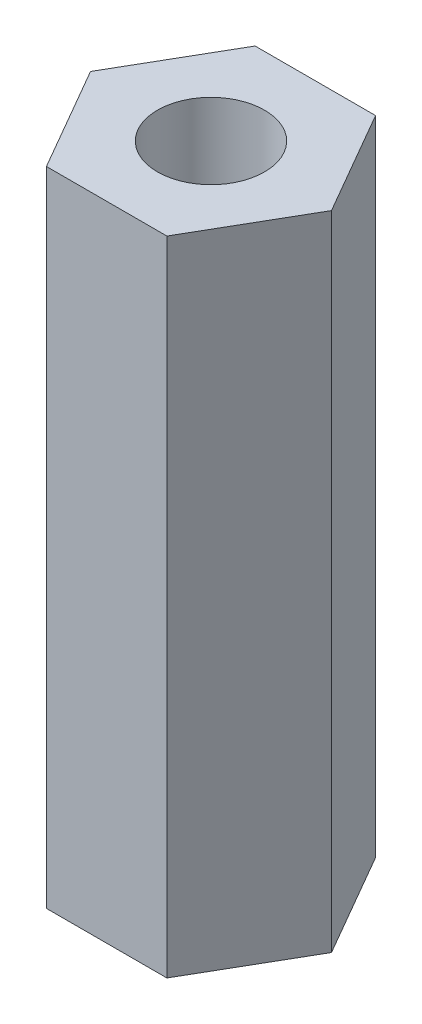
ISO-10303-21;
HEADER;
FILE_DESCRIPTION(('STEP AP214'),'2;1');
FILE_NAME('part.step','',(''),(''),'','','');
FILE_SCHEMA(('AUTOMOTIVE_DESIGN { 1 0 10303 214 1 1 1 1 }'));
ENDSEC;
DATA;
#1=APPLICATION_CONTEXT('core data for automotive mechanical design processes');
#2=APPLICATION_PROTOCOL_DEFINITION('international standard','automotive_design',2000,#1);
#3=PRODUCT_CONTEXT('',#1,'mechanical');
#4=PRODUCT('Part','Part','',(#3));
#5=PRODUCT_RELATED_PRODUCT_CATEGORY('part','',(#4));
#6=PRODUCT_DEFINITION_FORMATION('','',#4);
#7=PRODUCT_DEFINITION_CONTEXT('part definition',#1,'design');
#8=PRODUCT_DEFINITION('design','',#6,#7);
#9=PRODUCT_DEFINITION_SHAPE('','',#8);
#10=(LENGTH_UNIT() NAMED_UNIT(*) SI_UNIT(.MILLI.,.METRE.));
#11=(NAMED_UNIT(*) PLANE_ANGLE_UNIT() SI_UNIT($,.RADIAN.));
#12=(NAMED_UNIT(*) SI_UNIT($,.STERADIAN.) SOLID_ANGLE_UNIT());
#13=UNCERTAINTY_MEASURE_WITH_UNIT(LENGTH_MEASURE(1.E-05),#10,'distance_accuracy_value','');
#14=(GEOMETRIC_REPRESENTATION_CONTEXT(3) GLOBAL_UNCERTAINTY_ASSIGNED_CONTEXT((#13)) GLOBAL_UNIT_ASSIGNED_CONTEXT((#10,
#11,#12)) REPRESENTATION_CONTEXT('',''));
#15=CARTESIAN_POINT('',(0.,0.,0.));
#16=DIRECTION('',(0.,0.,1.));
#17=DIRECTION('',(1.,0.,0.));
#18=AXIS2_PLACEMENT_3D('',#15,#16,#17);
#19=CARTESIAN_POINT('',(0.,12.,0.));
#20=DIRECTION('',(0.,1.,0.));
#21=DIRECTION('',(0.,0.,1.));
#22=AXIS2_PLACEMENT_3D('',#19,#20,#21);
#23=PLANE('',#22);
#24=DIRECTION('',(0.5,0.,-0.866025403784439));
#25=VECTOR('',#24,1.);
#26=CARTESIAN_POINT('',(1.125,12.,1.94855715851499));
#27=LINE('',#26,#25);
#28=CARTESIAN_POINT('',(1.125,12.,1.94855715851499));
#29=VERTEX_POINT('',#28);
#30=CARTESIAN_POINT('',(2.25,12.,0.));
#31=VERTEX_POINT('',#30);
#32=EDGE_CURVE('E131',#29,#31,#27,.T.);
#33=ORIENTED_EDGE('',*,*,#32,.T.);
#34=DIRECTION('',(-0.5,0.,-0.866025403784438));
#35=VECTOR('',#34,1.);
#36=CARTESIAN_POINT('',(2.25,12.,0.));
#37=LINE('',#36,#35);
#38=CARTESIAN_POINT('',(1.125,12.,-1.94855715851499));
#39=VERTEX_POINT('',#38);
#40=EDGE_CURVE('E89',#31,#39,#37,.T.);
#41=ORIENTED_EDGE('',*,*,#40,.T.);
#42=DIRECTION('',(-1.,0.,0.));
#43=VECTOR('',#42,1.);
#44=CARTESIAN_POINT('',(1.125,12.,-1.94855715851499));
#45=LINE('',#44,#43);
#46=CARTESIAN_POINT('',(-1.125,12.,-1.94855715851499));
#47=VERTEX_POINT('',#46);
#48=EDGE_CURVE('E102',#39,#47,#45,.T.);
#49=ORIENTED_EDGE('',*,*,#48,.T.);
#50=DIRECTION('',(-0.5,0.,0.866025403784439));
#51=VECTOR('',#50,1.);
#52=CARTESIAN_POINT('',(-1.125,12.,-1.94855715851499));
#53=LINE('',#52,#51);
#54=CARTESIAN_POINT('',(-2.25,12.,0.));
#55=VERTEX_POINT('',#54);
#56=EDGE_CURVE('E96',#47,#55,#53,.T.);
#57=ORIENTED_EDGE('',*,*,#56,.T.);
#58=DIRECTION('',(0.5,0.,0.866025403784438));
#59=VECTOR('',#58,1.);
#60=CARTESIAN_POINT('',(-2.25,12.,0.));
#61=LINE('',#60,#59);
#62=CARTESIAN_POINT('',(-1.125,12.,1.94855715851499));
#63=VERTEX_POINT('',#62);
#64=EDGE_CURVE('E100',#55,#63,#61,.T.);
#65=ORIENTED_EDGE('',*,*,#64,.T.);
#66=DIRECTION('',(1.,0.,0.));
#67=VECTOR('',#66,1.);
#68=CARTESIAN_POINT('',(-1.125,12.,1.94855715851499));
#69=LINE('',#68,#67);
#70=EDGE_CURVE('E52',#63,#29,#69,.T.);
#71=ORIENTED_EDGE('',*,*,#70,.T.);
#72=EDGE_LOOP('',(#33,#41,#49,#57,#65,#71));
#73=FACE_BOUND('',#72,.T.);
#74=CARTESIAN_POINT('',(0.,12.,0.));
#75=DIRECTION('',(0.,1.,0.));
#76=DIRECTION('',(0.,0.,1.));
#77=AXIS2_PLACEMENT_3D('',#74,#75,#76);
#78=CIRCLE('',#77,1.);
#79=CARTESIAN_POINT('',(0.,12.,1.));
#80=VERTEX_POINT('',#79);
#81=EDGE_CURVE('E124',#80,#80,#78,.T.);
#82=ORIENTED_EDGE('',*,*,#81,.F.);
#83=EDGE_LOOP('',(#82));
#84=FACE_BOUND('',#83,.T.);
#85=ADVANCED_FACE('F35',(#73,#84),#23,.T.);
#86=CARTESIAN_POINT('',(0.,0.,0.));
#87=DIRECTION('',(0.,1.,0.));
#88=DIRECTION('',(0.,0.,1.));
#89=AXIS2_PLACEMENT_3D('',#86,#87,#88);
#90=PLANE('',#89);
#91=DIRECTION('',(0.5,0.,-0.866025403784439));
#92=VECTOR('',#91,1.);
#93=CARTESIAN_POINT('',(1.125,0.,1.94855715851499));
#94=LINE('',#93,#92);
#95=CARTESIAN_POINT('',(1.125,0.,1.94855715851499));
#96=VERTEX_POINT('',#95);
#97=CARTESIAN_POINT('',(2.25,0.,0.));
#98=VERTEX_POINT('',#97);
#99=EDGE_CURVE('E120',#96,#98,#94,.T.);
#100=ORIENTED_EDGE('',*,*,#99,.F.);
#101=DIRECTION('',(1.,0.,0.));
#102=VECTOR('',#101,1.);
#103=CARTESIAN_POINT('',(-1.125,0.,1.94855715851499));
#104=LINE('',#103,#102);
#105=CARTESIAN_POINT('',(-1.125,0.,1.94855715851499));
#106=VERTEX_POINT('',#105);
#107=EDGE_CURVE('E81',#106,#96,#104,.T.);
#108=ORIENTED_EDGE('',*,*,#107,.F.);
#109=DIRECTION('',(0.5,0.,0.866025403784438));
#110=VECTOR('',#109,1.);
#111=CARTESIAN_POINT('',(-2.25,0.,0.));
#112=LINE('',#111,#110);
#113=CARTESIAN_POINT('',(-2.25,0.,0.));
#114=VERTEX_POINT('',#113);
#115=EDGE_CURVE('E75',#114,#106,#112,.T.);
#116=ORIENTED_EDGE('',*,*,#115,.F.);
#117=DIRECTION('',(-0.5,0.,0.866025403784439));
#118=VECTOR('',#117,1.);
#119=CARTESIAN_POINT('',(-1.125,0.,-1.94855715851499));
#120=LINE('',#119,#118);
#121=CARTESIAN_POINT('',(-1.125,0.,-1.94855715851499));
#122=VERTEX_POINT('',#121);
#123=EDGE_CURVE('E110',#122,#114,#120,.T.);
#124=ORIENTED_EDGE('',*,*,#123,.F.);
#125=DIRECTION('',(-1.,0.,0.));
#126=VECTOR('',#125,1.);
#127=CARTESIAN_POINT('',(1.125,0.,-1.94855715851499));
#128=LINE('',#127,#126);
#129=CARTESIAN_POINT('',(1.125,0.,-1.94855715851499));
#130=VERTEX_POINT('',#129);
#131=EDGE_CURVE('E126',#130,#122,#128,.T.);
#132=ORIENTED_EDGE('',*,*,#131,.F.);
#133=DIRECTION('',(-0.5,0.,-0.866025403784438));
#134=VECTOR('',#133,1.);
#135=CARTESIAN_POINT('',(2.25,0.,0.));
#136=LINE('',#135,#134);
#137=EDGE_CURVE('E123',#98,#130,#136,.T.);
#138=ORIENTED_EDGE('',*,*,#137,.F.);
#139=EDGE_LOOP('',(#100,#108,#116,#124,#132,#138));
#140=FACE_BOUND('',#139,.T.);
#141=CARTESIAN_POINT('',(0.,0.,0.));
#142=DIRECTION('',(0.,1.,0.));
#143=DIRECTION('',(0.,0.,1.));
#144=AXIS2_PLACEMENT_3D('',#141,#142,#143);
#145=CIRCLE('',#144,1.);
#146=CARTESIAN_POINT('',(0.,0.,1.));
#147=VERTEX_POINT('',#146);
#148=EDGE_CURVE('E224',#147,#147,#145,.T.);
#149=ORIENTED_EDGE('',*,*,#148,.T.);
#150=EDGE_LOOP('',(#149));
#151=FACE_BOUND('',#150,.T.);
#152=ADVANCED_FACE('F140',(#140,#151),#90,.F.);
#153=CARTESIAN_POINT('',(1.125,12.,1.94855715851499));
#154=DIRECTION('',(-0.866025403784439,0.,-0.5));
#155=DIRECTION('',(-0.5,0.,0.866025403784439));
#156=AXIS2_PLACEMENT_3D('',#153,#154,#155);
#157=PLANE('',#156);
#158=ORIENTED_EDGE('',*,*,#99,.T.);
#159=DIRECTION('',(0.,-1.,0.));
#160=VECTOR('',#159,1.);
#161=CARTESIAN_POINT('',(2.25,12.,0.));
#162=LINE('',#161,#160);
#163=EDGE_CURVE('E11',#31,#98,#162,.T.);
#164=ORIENTED_EDGE('',*,*,#163,.F.);
#165=ORIENTED_EDGE('',*,*,#32,.F.);
#166=DIRECTION('',(0.,-1.,0.));
#167=VECTOR('',#166,1.);
#168=CARTESIAN_POINT('',(1.125,12.,1.94855715851499));
#169=LINE('',#168,#167);
#170=EDGE_CURVE('E116',#29,#96,#169,.T.);
#171=ORIENTED_EDGE('',*,*,#170,.T.);
#172=EDGE_LOOP('',(#158,#164,#165,#171));
#173=FACE_BOUND('',#172,.T.);
#174=ADVANCED_FACE('F37',(#173),#157,.F.);
#175=CARTESIAN_POINT('',(2.25,12.,0.));
#176=DIRECTION('',(-0.866025403784438,0.,0.5));
#177=DIRECTION('',(0.5,0.,0.866025403784438));
#178=AXIS2_PLACEMENT_3D('',#175,#176,#177);
#179=PLANE('',#178);
#180=ORIENTED_EDGE('',*,*,#137,.T.);
#181=DIRECTION('',(0.,-1.,0.));
#182=VECTOR('',#181,1.);
#183=CARTESIAN_POINT('',(1.125,12.,-1.94855715851499));
#184=LINE('',#183,#182);
#185=EDGE_CURVE('E44',#39,#130,#184,.T.);
#186=ORIENTED_EDGE('',*,*,#185,.F.);
#187=ORIENTED_EDGE('',*,*,#40,.F.);
#188=ORIENTED_EDGE('',*,*,#163,.T.);
#189=EDGE_LOOP('',(#180,#186,#187,#188));
#190=FACE_BOUND('',#189,.T.);
#191=ADVANCED_FACE('F165',(#190),#179,.F.);
#192=CARTESIAN_POINT('',(1.125,12.,-1.94855715851499));
#193=DIRECTION('',(0.,0.,1.));
#194=DIRECTION('',(1.,0.,0.));
#195=AXIS2_PLACEMENT_3D('',#192,#193,#194);
#196=PLANE('',#195);
#197=ORIENTED_EDGE('',*,*,#131,.T.);
#198=DIRECTION('',(0.,-1.,0.));
#199=VECTOR('',#198,1.);
#200=CARTESIAN_POINT('',(-1.125,12.,-1.94855715851499));
#201=LINE('',#200,#199);
#202=EDGE_CURVE('E111',#47,#122,#201,.T.);
#203=ORIENTED_EDGE('',*,*,#202,.F.);
#204=ORIENTED_EDGE('',*,*,#48,.F.);
#205=ORIENTED_EDGE('',*,*,#185,.T.);
#206=EDGE_LOOP('',(#197,#203,#204,#205));
#207=FACE_BOUND('',#206,.T.);
#208=ADVANCED_FACE('F137',(#207),#196,.F.);
#209=CARTESIAN_POINT('',(-1.125,12.,-1.94855715851499));
#210=DIRECTION('',(0.866025403784438,0.,0.5));
#211=DIRECTION('',(0.5,0.,-0.866025403784439));
#212=AXIS2_PLACEMENT_3D('',#209,#210,#211);
#213=PLANE('',#212);
#214=ORIENTED_EDGE('',*,*,#123,.T.);
#215=DIRECTION('',(0.,-1.,0.));
#216=VECTOR('',#215,1.);
#217=CARTESIAN_POINT('',(-2.25,12.,0.));
#218=LINE('',#217,#216);
#219=EDGE_CURVE('E107',#55,#114,#218,.T.);
#220=ORIENTED_EDGE('',*,*,#219,.F.);
#221=ORIENTED_EDGE('',*,*,#56,.F.);
#222=ORIENTED_EDGE('',*,*,#202,.T.);
#223=EDGE_LOOP('',(#214,#220,#221,#222));
#224=FACE_BOUND('',#223,.T.);
#225=ADVANCED_FACE('F108',(#224),#213,.F.);
#226=CARTESIAN_POINT('',(-2.25,12.,0.));
#227=DIRECTION('',(0.866025403784439,0.,-0.5));
#228=DIRECTION('',(-0.5,0.,-0.866025403784439));
#229=AXIS2_PLACEMENT_3D('',#226,#227,#228);
#230=PLANE('',#229);
#231=ORIENTED_EDGE('',*,*,#115,.T.);
#232=DIRECTION('',(0.,-1.,0.));
#233=VECTOR('',#232,1.);
#234=CARTESIAN_POINT('',(-1.125,12.,1.94855715851499));
#235=LINE('',#234,#233);
#236=EDGE_CURVE('E112',#63,#106,#235,.T.);
#237=ORIENTED_EDGE('',*,*,#236,.F.);
#238=ORIENTED_EDGE('',*,*,#64,.F.);
#239=ORIENTED_EDGE('',*,*,#219,.T.);
#240=EDGE_LOOP('',(#231,#237,#238,#239));
#241=FACE_BOUND('',#240,.T.);
#242=ADVANCED_FACE('F114',(#241),#230,.F.);
#243=CARTESIAN_POINT('',(-1.125,12.,1.94855715851499));
#244=DIRECTION('',(0.,0.,-1.));
#245=DIRECTION('',(-1.,0.,0.));
#246=AXIS2_PLACEMENT_3D('',#243,#244,#245);
#247=PLANE('',#246);
#248=ORIENTED_EDGE('',*,*,#107,.T.);
#249=ORIENTED_EDGE('',*,*,#170,.F.);
#250=ORIENTED_EDGE('',*,*,#70,.F.);
#251=ORIENTED_EDGE('',*,*,#236,.T.);
#252=EDGE_LOOP('',(#248,#249,#250,#251));
#253=FACE_BOUND('',#252,.T.);
#254=ADVANCED_FACE('F145',(#253),#247,.F.);
#255=CARTESIAN_POINT('',(0.,12.,0.));
#256=DIRECTION('',(0.,-1.,0.));
#257=DIRECTION('',(0.,0.,-1.));
#258=AXIS2_PLACEMENT_3D('',#255,#256,#257);
#259=CYLINDRICAL_SURFACE('',#258,1.);
#260=ORIENTED_EDGE('',*,*,#81,.T.);
#261=EDGE_LOOP('',(#260));
#262=FACE_BOUND('',#261,.T.);
#263=ORIENTED_EDGE('',*,*,#148,.F.);
#264=EDGE_LOOP('',(#263));
#265=FACE_BOUND('',#264,.T.);
#266=ADVANCED_FACE('F147',(#262,#265),#259,.F.);
#267=CLOSED_SHELL('',(#85,#152,#174,#191,#208,#225,#242,#254,#266));
#268=MANIFOLD_SOLID_BREP('B2',#267);
#269=ADVANCED_BREP_SHAPE_REPRESENTATION('',(#18,#268),#14);
#270=SHAPE_DEFINITION_REPRESENTATION(#9,#269);
ENDSEC;
END-ISO-10303-21;
